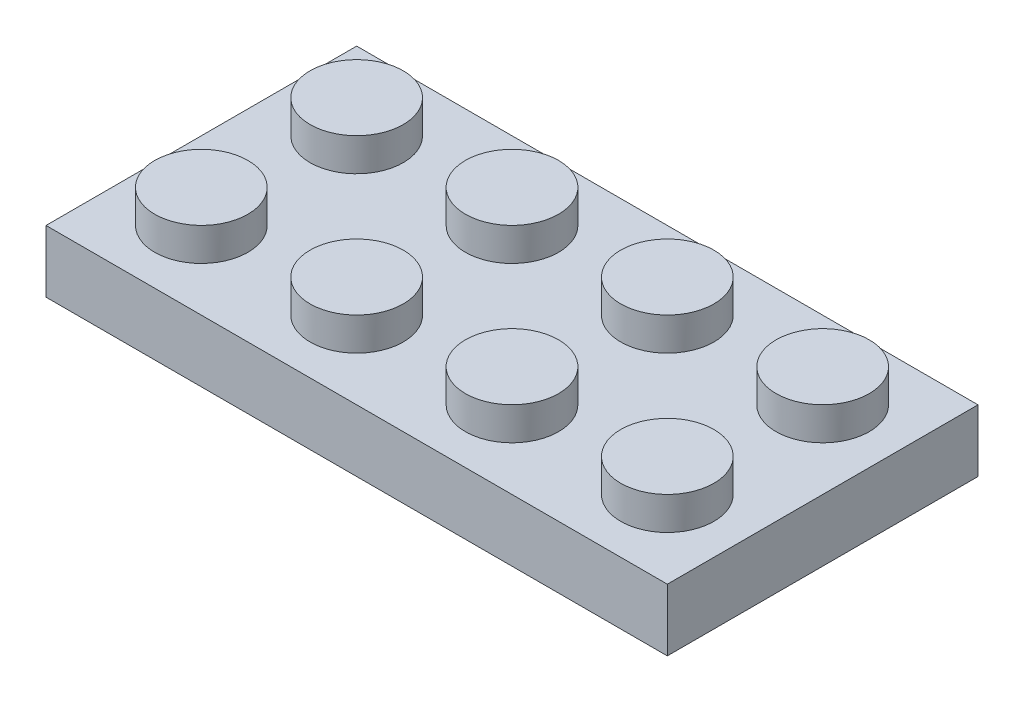
ISO-10303-21;
HEADER;
FILE_DESCRIPTION(('STEP AP214'),'2;1');
FILE_NAME('part.step','',(''),(''),'','','');
FILE_SCHEMA(('AUTOMOTIVE_DESIGN { 1 0 10303 214 1 1 1 1 }'));
ENDSEC;
DATA;
#1=APPLICATION_CONTEXT('core data for automotive mechanical design processes');
#2=APPLICATION_PROTOCOL_DEFINITION('international standard','automotive_design',2000,#1);
#3=PRODUCT_CONTEXT('',#1,'mechanical');
#4=PRODUCT('Part','Part','',(#3));
#5=PRODUCT_RELATED_PRODUCT_CATEGORY('part','',(#4));
#6=PRODUCT_DEFINITION_FORMATION('','',#4);
#7=PRODUCT_DEFINITION_CONTEXT('part definition',#1,'design');
#8=PRODUCT_DEFINITION('design','',#6,#7);
#9=PRODUCT_DEFINITION_SHAPE('','',#8);
#10=(LENGTH_UNIT() NAMED_UNIT(*) SI_UNIT(.MILLI.,.METRE.));
#11=(NAMED_UNIT(*) PLANE_ANGLE_UNIT() SI_UNIT($,.RADIAN.));
#12=(NAMED_UNIT(*) SI_UNIT($,.STERADIAN.) SOLID_ANGLE_UNIT());
#13=UNCERTAINTY_MEASURE_WITH_UNIT(LENGTH_MEASURE(1.E-05),#10,'distance_accuracy_value','');
#14=(GEOMETRIC_REPRESENTATION_CONTEXT(3) GLOBAL_UNCERTAINTY_ASSIGNED_CONTEXT((#13)) GLOBAL_UNIT_ASSIGNED_CONTEXT((#10,
#11,#12)) REPRESENTATION_CONTEXT('',''));
#15=CARTESIAN_POINT('',(0.,0.,0.));
#16=DIRECTION('',(0.,0.,1.));
#17=DIRECTION('',(1.,0.,0.));
#18=AXIS2_PLACEMENT_3D('',#15,#16,#17);
#19=CARTESIAN_POINT('',(0.,0.,0.));
#20=DIRECTION('',(0.,-1.,0.));
#21=DIRECTION('',(0.,0.,-1.));
#22=AXIS2_PLACEMENT_3D('',#19,#20,#21);
#23=PLANE('',#22);
#24=DIRECTION('',(-1.,0.,0.));
#25=VECTOR('',#24,1.);
#26=CARTESIAN_POINT('',(-4.,0.,-4.));
#27=LINE('',#26,#25);
#28=CARTESIAN_POINT('',(28.,0.,-4.));
#29=VERTEX_POINT('',#28);
#30=CARTESIAN_POINT('',(-4.,0.,-4.));
#31=VERTEX_POINT('',#30);
#32=EDGE_CURVE('E230',#29,#31,#27,.T.);
#33=ORIENTED_EDGE('',*,*,#32,.F.);
#34=DIRECTION('',(0.,0.,-1.));
#35=VECTOR('',#34,1.);
#36=CARTESIAN_POINT('',(28.,0.,4.));
#37=LINE('',#36,#35);
#38=CARTESIAN_POINT('',(28.,0.,12.));
#39=VERTEX_POINT('',#38);
#40=EDGE_CURVE('E197',#39,#29,#37,.T.);
#41=ORIENTED_EDGE('',*,*,#40,.F.);
#42=DIRECTION('',(1.,0.,0.));
#43=VECTOR('',#42,1.);
#44=CARTESIAN_POINT('',(-4.,0.,12.));
#45=LINE('',#44,#43);
#46=CARTESIAN_POINT('',(-4.,0.,12.));
#47=VERTEX_POINT('',#46);
#48=EDGE_CURVE('E220',#47,#39,#45,.T.);
#49=ORIENTED_EDGE('',*,*,#48,.F.);
#50=DIRECTION('',(0.,0.,1.));
#51=VECTOR('',#50,1.);
#52=CARTESIAN_POINT('',(-4.,0.,4.));
#53=LINE('',#52,#51);
#54=EDGE_CURVE('E238',#31,#47,#53,.T.);
#55=ORIENTED_EDGE('',*,*,#54,.F.);
#56=EDGE_LOOP('',(#33,#41,#49,#55));
#57=FACE_BOUND('',#56,.T.);
#58=DIRECTION('',(0.,0.,-1.));
#59=VECTOR('',#58,1.);
#60=CARTESIAN_POINT('',(26.4,0.,0.));
#61=LINE('',#60,#59);
#62=CARTESIAN_POINT('',(26.4,0.,10.4));
#63=VERTEX_POINT('',#62);
#64=CARTESIAN_POINT('',(26.4,0.,-2.4));
#65=VERTEX_POINT('',#64);
#66=EDGE_CURVE('E119',#63,#65,#61,.T.);
#67=ORIENTED_EDGE('',*,*,#66,.T.);
#68=DIRECTION('',(-1.,0.,0.));
#69=VECTOR('',#68,1.);
#70=CARTESIAN_POINT('',(0.,0.,-2.4));
#71=LINE('',#70,#69);
#72=CARTESIAN_POINT('',(-2.4,0.,-2.4));
#73=VERTEX_POINT('',#72);
#74=EDGE_CURVE('E123',#65,#73,#71,.T.);
#75=ORIENTED_EDGE('',*,*,#74,.T.);
#76=DIRECTION('',(0.,0.,1.));
#77=VECTOR('',#76,1.);
#78=CARTESIAN_POINT('',(-2.4,0.,0.));
#79=LINE('',#78,#77);
#80=CARTESIAN_POINT('',(-2.4,0.,10.4));
#81=VERTEX_POINT('',#80);
#82=EDGE_CURVE('E111',#73,#81,#79,.T.);
#83=ORIENTED_EDGE('',*,*,#82,.T.);
#84=DIRECTION('',(1.,0.,0.));
#85=VECTOR('',#84,1.);
#86=CARTESIAN_POINT('',(0.,0.,10.4));
#87=LINE('',#86,#85);
#88=EDGE_CURVE('E49',#81,#63,#87,.T.);
#89=ORIENTED_EDGE('',*,*,#88,.T.);
#90=EDGE_LOOP('',(#67,#75,#83,#89));
#91=FACE_BOUND('',#90,.T.);
#92=ADVANCED_FACE('F34',(#57,#91),#23,.T.);
#93=CARTESIAN_POINT('',(-4.,3.2,-4.));
#94=DIRECTION('',(0.,0.,1.));
#95=DIRECTION('',(1.,0.,0.));
#96=AXIS2_PLACEMENT_3D('',#93,#94,#95);
#97=PLANE('',#96);
#98=ORIENTED_EDGE('',*,*,#32,.T.);
#99=DIRECTION('',(0.,-1.,0.));
#100=VECTOR('',#99,1.);
#101=CARTESIAN_POINT('',(-4.,3.2,-4.));
#102=LINE('',#101,#100);
#103=CARTESIAN_POINT('',(-4.,3.2,-4.));
#104=VERTEX_POINT('',#103);
#105=EDGE_CURVE('E235',#104,#31,#102,.T.);
#106=ORIENTED_EDGE('',*,*,#105,.F.);
#107=DIRECTION('',(-1.,0.,0.));
#108=VECTOR('',#107,1.);
#109=CARTESIAN_POINT('',(-4.,3.2,-4.));
#110=LINE('',#109,#108);
#111=CARTESIAN_POINT('',(28.,3.2,-4.));
#112=VERTEX_POINT('',#111);
#113=EDGE_CURVE('E58',#112,#104,#110,.T.);
#114=ORIENTED_EDGE('',*,*,#113,.F.);
#115=DIRECTION('',(0.,-1.,0.));
#116=VECTOR('',#115,1.);
#117=CARTESIAN_POINT('',(28.,3.2,-4.));
#118=LINE('',#117,#116);
#119=EDGE_CURVE('E200',#112,#29,#118,.T.);
#120=ORIENTED_EDGE('',*,*,#119,.T.);
#121=EDGE_LOOP('',(#98,#106,#114,#120));
#122=FACE_BOUND('',#121,.T.);
#123=ADVANCED_FACE('F36',(#122),#97,.F.);
#124=CARTESIAN_POINT('',(-4.,3.2,4.));
#125=DIRECTION('',(1.,0.,0.));
#126=DIRECTION('',(0.,0.,-1.));
#127=AXIS2_PLACEMENT_3D('',#124,#125,#126);
#128=PLANE('',#127);
#129=ORIENTED_EDGE('',*,*,#54,.T.);
#130=DIRECTION('',(0.,-1.,0.));
#131=VECTOR('',#130,1.);
#132=CARTESIAN_POINT('',(-4.,3.2,12.));
#133=LINE('',#132,#131);
#134=CARTESIAN_POINT('',(-4.,3.2,12.));
#135=VERTEX_POINT('',#134);
#136=EDGE_CURVE('E223',#135,#47,#133,.T.);
#137=ORIENTED_EDGE('',*,*,#136,.F.);
#138=DIRECTION('',(0.,0.,1.));
#139=VECTOR('',#138,1.);
#140=CARTESIAN_POINT('',(-4.,3.2,4.));
#141=LINE('',#140,#139);
#142=EDGE_CURVE('E237',#104,#135,#141,.T.);
#143=ORIENTED_EDGE('',*,*,#142,.F.);
#144=ORIENTED_EDGE('',*,*,#105,.T.);
#145=EDGE_LOOP('',(#129,#137,#143,#144));
#146=FACE_BOUND('',#145,.T.);
#147=ADVANCED_FACE('F303',(#146),#128,.F.);
#148=CARTESIAN_POINT('',(0.,3.2,0.));
#149=DIRECTION('',(0.,-1.,0.));
#150=DIRECTION('',(0.,0.,-1.));
#151=AXIS2_PLACEMENT_3D('',#148,#149,#150);
#152=PLANE('',#151);
#153=CARTESIAN_POINT('',(24.,3.2,8.));
#154=DIRECTION('',(0.,-1.,0.));
#155=DIRECTION('',(0.,0.,-1.));
#156=AXIS2_PLACEMENT_3D('',#153,#154,#155);
#157=CIRCLE('',#156,2.4);
#158=CARTESIAN_POINT('',(24.,3.2,5.6));
#159=VERTEX_POINT('',#158);
#160=EDGE_CURVE('E261',#159,#159,#157,.F.);
#161=ORIENTED_EDGE('',*,*,#160,.F.);
#162=EDGE_LOOP('',(#161));
#163=FACE_BOUND('',#162,.T.);
#164=CARTESIAN_POINT('',(24.,3.2,0.));
#165=DIRECTION('',(0.,-1.,0.));
#166=DIRECTION('',(0.,0.,-1.));
#167=AXIS2_PLACEMENT_3D('',#164,#165,#166);
#168=CIRCLE('',#167,2.4);
#169=CARTESIAN_POINT('',(24.,3.2,-2.4));
#170=VERTEX_POINT('',#169);
#171=EDGE_CURVE('E258',#170,#170,#168,.F.);
#172=ORIENTED_EDGE('',*,*,#171,.F.);
#173=EDGE_LOOP('',(#172));
#174=FACE_BOUND('',#173,.T.);
#175=CARTESIAN_POINT('',(16.,3.2,8.));
#176=DIRECTION('',(0.,-1.,0.));
#177=DIRECTION('',(0.,0.,-1.));
#178=AXIS2_PLACEMENT_3D('',#175,#176,#177);
#179=CIRCLE('',#178,2.4);
#180=CARTESIAN_POINT('',(16.,3.2,5.6));
#181=VERTEX_POINT('',#180);
#182=EDGE_CURVE('E255',#181,#181,#179,.F.);
#183=ORIENTED_EDGE('',*,*,#182,.F.);
#184=EDGE_LOOP('',(#183));
#185=FACE_BOUND('',#184,.T.);
#186=CARTESIAN_POINT('',(16.,3.2,0.));
#187=DIRECTION('',(0.,-1.,0.));
#188=DIRECTION('',(0.,0.,-1.));
#189=AXIS2_PLACEMENT_3D('',#186,#187,#188);
#190=CIRCLE('',#189,2.4);
#191=CARTESIAN_POINT('',(16.,3.2,-2.4));
#192=VERTEX_POINT('',#191);
#193=EDGE_CURVE('E252',#192,#192,#190,.F.);
#194=ORIENTED_EDGE('',*,*,#193,.F.);
#195=EDGE_LOOP('',(#194));
#196=FACE_BOUND('',#195,.T.);
#197=CARTESIAN_POINT('',(8.,3.2,8.));
#198=DIRECTION('',(0.,-1.,0.));
#199=DIRECTION('',(0.,0.,-1.));
#200=AXIS2_PLACEMENT_3D('',#197,#198,#199);
#201=CIRCLE('',#200,2.4);
#202=CARTESIAN_POINT('',(8.,3.2,5.6));
#203=VERTEX_POINT('',#202);
#204=EDGE_CURVE('E249',#203,#203,#201,.F.);
#205=ORIENTED_EDGE('',*,*,#204,.F.);
#206=EDGE_LOOP('',(#205));
#207=FACE_BOUND('',#206,.T.);
#208=CARTESIAN_POINT('',(8.,3.2,0.));
#209=DIRECTION('',(0.,-1.,0.));
#210=DIRECTION('',(0.,0.,-1.));
#211=AXIS2_PLACEMENT_3D('',#208,#209,#210);
#212=CIRCLE('',#211,2.4);
#213=CARTESIAN_POINT('',(8.,3.2,-2.4));
#214=VERTEX_POINT('',#213);
#215=EDGE_CURVE('E246',#214,#214,#212,.F.);
#216=ORIENTED_EDGE('',*,*,#215,.F.);
#217=EDGE_LOOP('',(#216));
#218=FACE_BOUND('',#217,.T.);
#219=CARTESIAN_POINT('',(0.,3.2,8.));
#220=DIRECTION('',(0.,-1.,0.));
#221=DIRECTION('',(0.,0.,-1.));
#222=AXIS2_PLACEMENT_3D('',#219,#220,#221);
#223=CIRCLE('',#222,2.4);
#224=CARTESIAN_POINT('',(0.,3.2,5.6));
#225=VERTEX_POINT('',#224);
#226=EDGE_CURVE('E234',#225,#225,#223,.F.);
#227=ORIENTED_EDGE('',*,*,#226,.F.);
#228=EDGE_LOOP('',(#227));
#229=FACE_BOUND('',#228,.T.);
#230=CARTESIAN_POINT('',(0.,3.2,0.));
#231=DIRECTION('',(0.,1.,0.));
#232=DIRECTION('',(0.,0.,1.));
#233=AXIS2_PLACEMENT_3D('',#230,#231,#232);
#234=CIRCLE('',#233,2.4);
#235=CARTESIAN_POINT('',(0.,3.2,2.4));
#236=VERTEX_POINT('',#235);
#237=EDGE_CURVE('E231',#236,#236,#234,.T.);
#238=ORIENTED_EDGE('',*,*,#237,.F.);
#239=EDGE_LOOP('',(#238));
#240=FACE_BOUND('',#239,.T.);
#241=DIRECTION('',(1.,0.,0.));
#242=VECTOR('',#241,1.);
#243=CARTESIAN_POINT('',(-4.,3.2,12.));
#244=LINE('',#243,#242);
#245=CARTESIAN_POINT('',(28.,3.2,12.));
#246=VERTEX_POINT('',#245);
#247=EDGE_CURVE('E221',#135,#246,#244,.T.);
#248=ORIENTED_EDGE('',*,*,#247,.T.);
#249=DIRECTION('',(0.,0.,-1.));
#250=VECTOR('',#249,1.);
#251=CARTESIAN_POINT('',(28.,3.2,4.));
#252=LINE('',#251,#250);
#253=EDGE_CURVE('E198',#246,#112,#252,.T.);
#254=ORIENTED_EDGE('',*,*,#253,.T.);
#255=ORIENTED_EDGE('',*,*,#113,.T.);
#256=ORIENTED_EDGE('',*,*,#142,.T.);
#257=EDGE_LOOP('',(#248,#254,#255,#256));
#258=FACE_BOUND('',#257,.T.);
#259=ADVANCED_FACE('F307',(#163,#174,#185,#196,#207,#218,#229,#240,#258),#152,.F.);
#260=CARTESIAN_POINT('',(0.,4.9,0.));
#261=DIRECTION('',(0.,-1.,0.));
#262=DIRECTION('',(0.,0.,-1.));
#263=AXIS2_PLACEMENT_3D('',#260,#261,#262);
#264=CYLINDRICAL_SURFACE('',#263,2.4);
#265=CARTESIAN_POINT('',(0.,4.9,0.));
#266=DIRECTION('',(0.,1.,0.));
#267=DIRECTION('',(0.,0.,1.));
#268=AXIS2_PLACEMENT_3D('',#265,#266,#267);
#269=CIRCLE('',#268,2.4);
#270=CARTESIAN_POINT('',(0.,4.9,2.4));
#271=VERTEX_POINT('',#270);
#272=EDGE_CURVE('E227',#271,#271,#269,.T.);
#273=ORIENTED_EDGE('',*,*,#272,.F.);
#274=EDGE_LOOP('',(#273));
#275=FACE_BOUND('',#274,.T.);
#276=ORIENTED_EDGE('',*,*,#237,.T.);
#277=EDGE_LOOP('',(#276));
#278=FACE_BOUND('',#277,.T.);
#279=ADVANCED_FACE('F314',(#275,#278),#264,.T.);
#280=CARTESIAN_POINT('',(0.,4.9,0.));
#281=DIRECTION('',(0.,1.,0.));
#282=DIRECTION('',(0.,0.,1.));
#283=AXIS2_PLACEMENT_3D('',#280,#281,#282);
#284=PLANE('',#283);
#285=ORIENTED_EDGE('',*,*,#272,.T.);
#286=EDGE_LOOP('',(#285));
#287=FACE_BOUND('',#286,.T.);
#288=ADVANCED_FACE('F382',(#287),#284,.T.);
#289=CARTESIAN_POINT('',(-4.,3.2,12.));
#290=DIRECTION('',(0.,0.,-1.));
#291=DIRECTION('',(-1.,0.,0.));
#292=AXIS2_PLACEMENT_3D('',#289,#290,#291);
#293=PLANE('',#292);
#294=ORIENTED_EDGE('',*,*,#48,.T.);
#295=DIRECTION('',(0.,-1.,0.));
#296=VECTOR('',#295,1.);
#297=CARTESIAN_POINT('',(28.,3.2,12.));
#298=LINE('',#297,#296);
#299=EDGE_CURVE('E194',#246,#39,#298,.T.);
#300=ORIENTED_EDGE('',*,*,#299,.F.);
#301=ORIENTED_EDGE('',*,*,#247,.F.);
#302=ORIENTED_EDGE('',*,*,#136,.T.);
#303=EDGE_LOOP('',(#294,#300,#301,#302));
#304=FACE_BOUND('',#303,.T.);
#305=ADVANCED_FACE('F322',(#304),#293,.F.);
#306=CARTESIAN_POINT('',(0.,4.9,8.));
#307=DIRECTION('',(0.,-1.,0.));
#308=DIRECTION('',(0.,0.,-1.));
#309=AXIS2_PLACEMENT_3D('',#306,#307,#308);
#310=CYLINDRICAL_SURFACE('',#309,2.4);
#311=CARTESIAN_POINT('',(0.,4.9,8.));
#312=DIRECTION('',(0.,1.,0.));
#313=DIRECTION('',(0.,0.,1.));
#314=AXIS2_PLACEMENT_3D('',#311,#312,#313);
#315=CIRCLE('',#314,2.4);
#316=CARTESIAN_POINT('',(0.,4.9,10.4));
#317=VERTEX_POINT('',#316);
#318=EDGE_CURVE('E217',#317,#317,#315,.T.);
#319=ORIENTED_EDGE('',*,*,#318,.F.);
#320=EDGE_LOOP('',(#319));
#321=FACE_BOUND('',#320,.T.);
#322=ORIENTED_EDGE('',*,*,#226,.T.);
#323=EDGE_LOOP('',(#322));
#324=FACE_BOUND('',#323,.T.);
#325=ADVANCED_FACE('F375',(#321,#324),#310,.T.);
#326=CARTESIAN_POINT('',(0.,4.9,8.));
#327=DIRECTION('',(0.,1.,0.));
#328=DIRECTION('',(0.,0.,1.));
#329=AXIS2_PLACEMENT_3D('',#326,#327,#328);
#330=PLANE('',#329);
#331=ORIENTED_EDGE('',*,*,#318,.T.);
#332=EDGE_LOOP('',(#331));
#333=FACE_BOUND('',#332,.T.);
#334=ADVANCED_FACE('F371',(#333),#330,.T.);
#335=CARTESIAN_POINT('',(8.,4.9,0.));
#336=DIRECTION('',(0.,-1.,0.));
#337=DIRECTION('',(0.,0.,-1.));
#338=AXIS2_PLACEMENT_3D('',#335,#336,#337);
#339=CYLINDRICAL_SURFACE('',#338,2.4);
#340=CARTESIAN_POINT('',(8.,4.9,0.));
#341=DIRECTION('',(0.,1.,0.));
#342=DIRECTION('',(0.,0.,1.));
#343=AXIS2_PLACEMENT_3D('',#340,#341,#342);
#344=CIRCLE('',#343,2.4);
#345=CARTESIAN_POINT('',(8.,4.9,2.4));
#346=VERTEX_POINT('',#345);
#347=EDGE_CURVE('E214',#346,#346,#344,.T.);
#348=ORIENTED_EDGE('',*,*,#347,.F.);
#349=EDGE_LOOP('',(#348));
#350=FACE_BOUND('',#349,.T.);
#351=ORIENTED_EDGE('',*,*,#215,.T.);
#352=EDGE_LOOP('',(#351));
#353=FACE_BOUND('',#352,.T.);
#354=ADVANCED_FACE('F367',(#350,#353),#339,.T.);
#355=CARTESIAN_POINT('',(8.,4.9,0.));
#356=DIRECTION('',(0.,1.,0.));
#357=DIRECTION('',(0.,0.,1.));
#358=AXIS2_PLACEMENT_3D('',#355,#356,#357);
#359=PLANE('',#358);
#360=ORIENTED_EDGE('',*,*,#347,.T.);
#361=EDGE_LOOP('',(#360));
#362=FACE_BOUND('',#361,.T.);
#363=ADVANCED_FACE('F363',(#362),#359,.T.);
#364=CARTESIAN_POINT('',(8.,4.9,8.));
#365=DIRECTION('',(0.,-1.,0.));
#366=DIRECTION('',(0.,0.,-1.));
#367=AXIS2_PLACEMENT_3D('',#364,#365,#366);
#368=CYLINDRICAL_SURFACE('',#367,2.4);
#369=CARTESIAN_POINT('',(8.,4.9,8.));
#370=DIRECTION('',(0.,1.,0.));
#371=DIRECTION('',(0.,0.,1.));
#372=AXIS2_PLACEMENT_3D('',#369,#370,#371);
#373=CIRCLE('',#372,2.4);
#374=CARTESIAN_POINT('',(8.,4.9,10.4));
#375=VERTEX_POINT('',#374);
#376=EDGE_CURVE('E211',#375,#375,#373,.T.);
#377=ORIENTED_EDGE('',*,*,#376,.F.);
#378=EDGE_LOOP('',(#377));
#379=FACE_BOUND('',#378,.T.);
#380=ORIENTED_EDGE('',*,*,#204,.T.);
#381=EDGE_LOOP('',(#380));
#382=FACE_BOUND('',#381,.T.);
#383=ADVANCED_FACE('F359',(#379,#382),#368,.T.);
#384=CARTESIAN_POINT('',(8.,4.9,8.));
#385=DIRECTION('',(0.,1.,0.));
#386=DIRECTION('',(0.,0.,1.));
#387=AXIS2_PLACEMENT_3D('',#384,#385,#386);
#388=PLANE('',#387);
#389=ORIENTED_EDGE('',*,*,#376,.T.);
#390=EDGE_LOOP('',(#389));
#391=FACE_BOUND('',#390,.T.);
#392=ADVANCED_FACE('F355',(#391),#388,.T.);
#393=CARTESIAN_POINT('',(16.,4.9,0.));
#394=DIRECTION('',(0.,-1.,0.));
#395=DIRECTION('',(0.,0.,-1.));
#396=AXIS2_PLACEMENT_3D('',#393,#394,#395);
#397=CYLINDRICAL_SURFACE('',#396,2.4);
#398=CARTESIAN_POINT('',(16.,4.9,0.));
#399=DIRECTION('',(0.,1.,0.));
#400=DIRECTION('',(0.,0.,1.));
#401=AXIS2_PLACEMENT_3D('',#398,#399,#400);
#402=CIRCLE('',#401,2.4);
#403=CARTESIAN_POINT('',(16.,4.9,2.4));
#404=VERTEX_POINT('',#403);
#405=EDGE_CURVE('E208',#404,#404,#402,.T.);
#406=ORIENTED_EDGE('',*,*,#405,.F.);
#407=EDGE_LOOP('',(#406));
#408=FACE_BOUND('',#407,.T.);
#409=ORIENTED_EDGE('',*,*,#193,.T.);
#410=EDGE_LOOP('',(#409));
#411=FACE_BOUND('',#410,.T.);
#412=ADVANCED_FACE('F351',(#408,#411),#397,.T.);
#413=CARTESIAN_POINT('',(16.,4.9,0.));
#414=DIRECTION('',(0.,1.,0.));
#415=DIRECTION('',(0.,0.,1.));
#416=AXIS2_PLACEMENT_3D('',#413,#414,#415);
#417=PLANE('',#416);
#418=ORIENTED_EDGE('',*,*,#405,.T.);
#419=EDGE_LOOP('',(#418));
#420=FACE_BOUND('',#419,.T.);
#421=ADVANCED_FACE('F347',(#420),#417,.T.);
#422=CARTESIAN_POINT('',(16.,4.9,8.));
#423=DIRECTION('',(0.,-1.,0.));
#424=DIRECTION('',(0.,0.,-1.));
#425=AXIS2_PLACEMENT_3D('',#422,#423,#424);
#426=CYLINDRICAL_SURFACE('',#425,2.4);
#427=CARTESIAN_POINT('',(16.,4.9,8.));
#428=DIRECTION('',(0.,1.,0.));
#429=DIRECTION('',(0.,0.,1.));
#430=AXIS2_PLACEMENT_3D('',#427,#428,#429);
#431=CIRCLE('',#430,2.4);
#432=CARTESIAN_POINT('',(16.,4.9,10.4));
#433=VERTEX_POINT('',#432);
#434=EDGE_CURVE('E205',#433,#433,#431,.T.);
#435=ORIENTED_EDGE('',*,*,#434,.F.);
#436=EDGE_LOOP('',(#435));
#437=FACE_BOUND('',#436,.T.);
#438=ORIENTED_EDGE('',*,*,#182,.T.);
#439=EDGE_LOOP('',(#438));
#440=FACE_BOUND('',#439,.T.);
#441=ADVANCED_FACE('F340',(#437,#440),#426,.T.);
#442=CARTESIAN_POINT('',(16.,4.9,8.));
#443=DIRECTION('',(0.,1.,0.));
#444=DIRECTION('',(0.,0.,1.));
#445=AXIS2_PLACEMENT_3D('',#442,#443,#444);
#446=PLANE('',#445);
#447=ORIENTED_EDGE('',*,*,#434,.T.);
#448=EDGE_LOOP('',(#447));
#449=FACE_BOUND('',#448,.T.);
#450=ADVANCED_FACE('F331',(#449),#446,.T.);
#451=CARTESIAN_POINT('',(28.,3.2,4.));
#452=DIRECTION('',(-1.,0.,0.));
#453=DIRECTION('',(0.,0.,1.));
#454=AXIS2_PLACEMENT_3D('',#451,#452,#453);
#455=PLANE('',#454);
#456=ORIENTED_EDGE('',*,*,#40,.T.);
#457=ORIENTED_EDGE('',*,*,#119,.F.);
#458=ORIENTED_EDGE('',*,*,#253,.F.);
#459=ORIENTED_EDGE('',*,*,#299,.T.);
#460=EDGE_LOOP('',(#456,#457,#458,#459));
#461=FACE_BOUND('',#460,.T.);
#462=ADVANCED_FACE('F328',(#461),#455,.F.);
#463=CARTESIAN_POINT('',(24.,4.9,0.));
#464=DIRECTION('',(0.,-1.,0.));
#465=DIRECTION('',(0.,0.,-1.));
#466=AXIS2_PLACEMENT_3D('',#463,#464,#465);
#467=CYLINDRICAL_SURFACE('',#466,2.4);
#468=CARTESIAN_POINT('',(24.,4.9,0.));
#469=DIRECTION('',(0.,1.,0.));
#470=DIRECTION('',(0.,0.,1.));
#471=AXIS2_PLACEMENT_3D('',#468,#469,#470);
#472=CIRCLE('',#471,2.4);
#473=CARTESIAN_POINT('',(24.,4.9,2.4));
#474=VERTEX_POINT('',#473);
#475=EDGE_CURVE('E191',#474,#474,#472,.T.);
#476=ORIENTED_EDGE('',*,*,#475,.F.);
#477=EDGE_LOOP('',(#476));
#478=FACE_BOUND('',#477,.T.);
#479=ORIENTED_EDGE('',*,*,#171,.T.);
#480=EDGE_LOOP('',(#479));
#481=FACE_BOUND('',#480,.T.);
#482=ADVANCED_FACE('F330',(#478,#481),#467,.T.);
#483=CARTESIAN_POINT('',(24.,4.9,0.));
#484=DIRECTION('',(0.,1.,0.));
#485=DIRECTION('',(0.,0.,1.));
#486=AXIS2_PLACEMENT_3D('',#483,#484,#485);
#487=PLANE('',#486);
#488=ORIENTED_EDGE('',*,*,#475,.T.);
#489=EDGE_LOOP('',(#488));
#490=FACE_BOUND('',#489,.T.);
#491=ADVANCED_FACE('F337',(#490),#487,.T.);
#492=CARTESIAN_POINT('',(24.,4.9,8.));
#493=DIRECTION('',(0.,-1.,0.));
#494=DIRECTION('',(0.,0.,-1.));
#495=AXIS2_PLACEMENT_3D('',#492,#493,#494);
#496=CYLINDRICAL_SURFACE('',#495,2.4);
#497=CARTESIAN_POINT('',(24.,4.9,8.));
#498=DIRECTION('',(0.,1.,0.));
#499=DIRECTION('',(0.,0.,1.));
#500=AXIS2_PLACEMENT_3D('',#497,#498,#499);
#501=CIRCLE('',#500,2.4);
#502=CARTESIAN_POINT('',(24.,4.9,10.4));
#503=VERTEX_POINT('',#502);
#504=EDGE_CURVE('E140',#503,#503,#501,.T.);
#505=ORIENTED_EDGE('',*,*,#504,.F.);
#506=EDGE_LOOP('',(#505));
#507=FACE_BOUND('',#506,.T.);
#508=ORIENTED_EDGE('',*,*,#160,.T.);
#509=EDGE_LOOP('',(#508));
#510=FACE_BOUND('',#509,.T.);
#511=ADVANCED_FACE('F464',(#507,#510),#496,.T.);
#512=CARTESIAN_POINT('',(24.,4.9,8.));
#513=DIRECTION('',(0.,1.,0.));
#514=DIRECTION('',(0.,0.,1.));
#515=AXIS2_PLACEMENT_3D('',#512,#513,#514);
#516=PLANE('',#515);
#517=ORIENTED_EDGE('',*,*,#504,.T.);
#518=EDGE_LOOP('',(#517));
#519=FACE_BOUND('',#518,.T.);
#520=ADVANCED_FACE('F473',(#519),#516,.T.);
#521=CARTESIAN_POINT('',(-4.,3.2,-2.4));
#522=DIRECTION('',(0.,0.,1.));
#523=DIRECTION('',(1.,0.,0.));
#524=AXIS2_PLACEMENT_3D('',#521,#522,#523);
#525=PLANE('',#524);
#526=ORIENTED_EDGE('',*,*,#74,.F.);
#527=DIRECTION('',(0.,-1.,0.));
#528=VECTOR('',#527,1.);
#529=CARTESIAN_POINT('',(26.4,3.2,-2.4));
#530=LINE('',#529,#528);
#531=CARTESIAN_POINT('',(26.4,1.6,-2.4));
#532=VERTEX_POINT('',#531);
#533=EDGE_CURVE('E116',#532,#65,#530,.T.);
#534=ORIENTED_EDGE('',*,*,#533,.F.);
#535=DIRECTION('',(-1.,0.,0.));
#536=VECTOR('',#535,1.);
#537=CARTESIAN_POINT('',(0.,1.6,-2.4));
#538=LINE('',#537,#536);
#539=CARTESIAN_POINT('',(-2.4,1.6,-2.4));
#540=VERTEX_POINT('',#539);
#541=EDGE_CURVE('E101',#532,#540,#538,.T.);
#542=ORIENTED_EDGE('',*,*,#541,.T.);
#543=DIRECTION('',(0.,-1.,0.));
#544=VECTOR('',#543,1.);
#545=CARTESIAN_POINT('',(-2.4,3.2,-2.4));
#546=LINE('',#545,#544);
#547=EDGE_CURVE('E136',#540,#73,#546,.T.);
#548=ORIENTED_EDGE('',*,*,#547,.T.);
#549=EDGE_LOOP('',(#526,#534,#542,#548));
#550=FACE_BOUND('',#549,.T.);
#551=ADVANCED_FACE('F121',(#550),#525,.T.);
#552=CARTESIAN_POINT('',(-2.4,3.2,4.));
#553=DIRECTION('',(1.,0.,0.));
#554=DIRECTION('',(0.,0.,-1.));
#555=AXIS2_PLACEMENT_3D('',#552,#553,#554);
#556=PLANE('',#555);
#557=ORIENTED_EDGE('',*,*,#82,.F.);
#558=ORIENTED_EDGE('',*,*,#547,.F.);
#559=DIRECTION('',(0.,0.,1.));
#560=VECTOR('',#559,1.);
#561=CARTESIAN_POINT('',(-2.4,1.6,0.));
#562=LINE('',#561,#560);
#563=CARTESIAN_POINT('',(-2.4,1.6,10.4));
#564=VERTEX_POINT('',#563);
#565=EDGE_CURVE('E107',#540,#564,#562,.T.);
#566=ORIENTED_EDGE('',*,*,#565,.T.);
#567=DIRECTION('',(0.,-1.,0.));
#568=VECTOR('',#567,1.);
#569=CARTESIAN_POINT('',(-2.4,3.2,10.4));
#570=LINE('',#569,#568);
#571=EDGE_CURVE('E131',#564,#81,#570,.T.);
#572=ORIENTED_EDGE('',*,*,#571,.T.);
#573=EDGE_LOOP('',(#557,#558,#566,#572));
#574=FACE_BOUND('',#573,.T.);
#575=ADVANCED_FACE('F499',(#574),#556,.T.);
#576=CARTESIAN_POINT('',(0.,1.6,0.));
#577=DIRECTION('',(0.,-1.,0.));
#578=DIRECTION('',(0.,0.,-1.));
#579=AXIS2_PLACEMENT_3D('',#576,#577,#578);
#580=PLANE('',#579);
#581=CARTESIAN_POINT('',(20.,1.6,4.));
#582=DIRECTION('',(0.,-1.,0.));
#583=DIRECTION('',(0.,0.,-1.));
#584=AXIS2_PLACEMENT_3D('',#581,#582,#583);
#585=CIRCLE('',#584,3.255);
#586=CARTESIAN_POINT('',(20.,1.6,0.745));
#587=VERTEX_POINT('',#586);
#588=EDGE_CURVE('E821',#587,#587,#585,.T.);
#589=ORIENTED_EDGE('',*,*,#588,.F.);
#590=EDGE_LOOP('',(#589));
#591=FACE_BOUND('',#590,.T.);
#592=CARTESIAN_POINT('',(12.,1.6,4.));
#593=DIRECTION('',(0.,-1.,0.));
#594=DIRECTION('',(0.,0.,-1.));
#595=AXIS2_PLACEMENT_3D('',#592,#593,#594);
#596=CIRCLE('',#595,3.255);
#597=CARTESIAN_POINT('',(12.,1.6,0.745));
#598=VERTEX_POINT('',#597);
#599=EDGE_CURVE('E824',#598,#598,#596,.T.);
#600=ORIENTED_EDGE('',*,*,#599,.F.);
#601=EDGE_LOOP('',(#600));
#602=FACE_BOUND('',#601,.T.);
#603=CARTESIAN_POINT('',(4.,1.6,4.));
#604=DIRECTION('',(0.,-1.,0.));
#605=DIRECTION('',(0.,0.,-1.));
#606=AXIS2_PLACEMENT_3D('',#603,#604,#605);
#607=CIRCLE('',#606,3.255);
#608=CARTESIAN_POINT('',(4.,1.6,0.745));
#609=VERTEX_POINT('',#608);
#610=EDGE_CURVE('E838',#609,#609,#607,.T.);
#611=ORIENTED_EDGE('',*,*,#610,.F.);
#612=EDGE_LOOP('',(#611));
#613=FACE_BOUND('',#612,.T.);
#614=CARTESIAN_POINT('',(24.,1.6,8.));
#615=DIRECTION('',(0.,-1.,0.));
#616=DIRECTION('',(0.,0.,-1.));
#617=AXIS2_PLACEMENT_3D('',#614,#615,#616);
#618=CIRCLE('',#617,0.8);
#619=CARTESIAN_POINT('',(24.,1.6,7.2));
#620=VERTEX_POINT('',#619);
#621=EDGE_CURVE('E137',#620,#620,#618,.F.);
#622=ORIENTED_EDGE('',*,*,#621,.T.);
#623=EDGE_LOOP('',(#622));
#624=FACE_BOUND('',#623,.T.);
#625=CARTESIAN_POINT('',(24.,1.6,0.));
#626=DIRECTION('',(0.,-1.,0.));
#627=DIRECTION('',(0.,0.,-1.));
#628=AXIS2_PLACEMENT_3D('',#625,#626,#627);
#629=CIRCLE('',#628,0.8);
#630=CARTESIAN_POINT('',(24.,1.6,-0.8));
#631=VERTEX_POINT('',#630);
#632=EDGE_CURVE('E141',#631,#631,#629,.F.);
#633=ORIENTED_EDGE('',*,*,#632,.T.);
#634=EDGE_LOOP('',(#633));
#635=FACE_BOUND('',#634,.T.);
#636=CARTESIAN_POINT('',(16.,1.6,8.));
#637=DIRECTION('',(0.,-1.,0.));
#638=DIRECTION('',(0.,0.,-1.));
#639=AXIS2_PLACEMENT_3D('',#636,#637,#638);
#640=CIRCLE('',#639,0.8);
#641=CARTESIAN_POINT('',(16.,1.6,7.2));
#642=VERTEX_POINT('',#641);
#643=EDGE_CURVE('E144',#642,#642,#640,.F.);
#644=ORIENTED_EDGE('',*,*,#643,.T.);
#645=EDGE_LOOP('',(#644));
#646=FACE_BOUND('',#645,.T.);
#647=CARTESIAN_POINT('',(16.,1.6,0.));
#648=DIRECTION('',(0.,-1.,0.));
#649=DIRECTION('',(0.,0.,-1.));
#650=AXIS2_PLACEMENT_3D('',#647,#648,#649);
#651=CIRCLE('',#650,0.8);
#652=CARTESIAN_POINT('',(16.,1.6,-0.8));
#653=VERTEX_POINT('',#652);
#654=EDGE_CURVE('E147',#653,#653,#651,.F.);
#655=ORIENTED_EDGE('',*,*,#654,.T.);
#656=EDGE_LOOP('',(#655));
#657=FACE_BOUND('',#656,.T.);
#658=CARTESIAN_POINT('',(8.,1.6,8.));
#659=DIRECTION('',(0.,-1.,0.));
#660=DIRECTION('',(0.,0.,-1.));
#661=AXIS2_PLACEMENT_3D('',#658,#659,#660);
#662=CIRCLE('',#661,0.8);
#663=CARTESIAN_POINT('',(8.,1.6,7.2));
#664=VERTEX_POINT('',#663);
#665=EDGE_CURVE('E150',#664,#664,#662,.F.);
#666=ORIENTED_EDGE('',*,*,#665,.T.);
#667=EDGE_LOOP('',(#666));
#668=FACE_BOUND('',#667,.T.);
#669=CARTESIAN_POINT('',(8.,1.6,0.));
#670=DIRECTION('',(0.,-1.,0.));
#671=DIRECTION('',(0.,0.,-1.));
#672=AXIS2_PLACEMENT_3D('',#669,#670,#671);
#673=CIRCLE('',#672,0.8);
#674=CARTESIAN_POINT('',(8.,1.6,-0.8));
#675=VERTEX_POINT('',#674);
#676=EDGE_CURVE('E153',#675,#675,#673,.F.);
#677=ORIENTED_EDGE('',*,*,#676,.T.);
#678=EDGE_LOOP('',(#677));
#679=FACE_BOUND('',#678,.T.);
#680=CARTESIAN_POINT('',(0.,1.6,8.));
#681=DIRECTION('',(0.,-1.,0.));
#682=DIRECTION('',(0.,0.,-1.));
#683=AXIS2_PLACEMENT_3D('',#680,#681,#682);
#684=CIRCLE('',#683,0.8);
#685=CARTESIAN_POINT('',(0.,1.6,7.2));
#686=VERTEX_POINT('',#685);
#687=EDGE_CURVE('E156',#686,#686,#684,.F.);
#688=ORIENTED_EDGE('',*,*,#687,.T.);
#689=EDGE_LOOP('',(#688));
#690=FACE_BOUND('',#689,.T.);
#691=CARTESIAN_POINT('',(0.,1.6,0.));
#692=DIRECTION('',(0.,-1.,0.));
#693=DIRECTION('',(0.,0.,-1.));
#694=AXIS2_PLACEMENT_3D('',#691,#692,#693);
#695=CIRCLE('',#694,0.8);
#696=CARTESIAN_POINT('',(0.,1.6,-0.8));
#697=VERTEX_POINT('',#696);
#698=EDGE_CURVE('E159',#697,#697,#695,.F.);
#699=ORIENTED_EDGE('',*,*,#698,.T.);
#700=EDGE_LOOP('',(#699));
#701=FACE_BOUND('',#700,.T.);
#702=DIRECTION('',(1.,0.,0.));
#703=VECTOR('',#702,1.);
#704=CARTESIAN_POINT('',(0.,1.6,10.4));
#705=LINE('',#704,#703);
#706=CARTESIAN_POINT('',(26.4,1.6,10.4));
#707=VERTEX_POINT('',#706);
#708=EDGE_CURVE('E134',#564,#707,#705,.T.);
#709=ORIENTED_EDGE('',*,*,#708,.F.);
#710=ORIENTED_EDGE('',*,*,#565,.F.);
#711=ORIENTED_EDGE('',*,*,#541,.F.);
#712=DIRECTION('',(0.,0.,-1.));
#713=VECTOR('',#712,1.);
#714=CARTESIAN_POINT('',(26.4,1.6,0.));
#715=LINE('',#714,#713);
#716=EDGE_CURVE('E105',#707,#532,#715,.T.);
#717=ORIENTED_EDGE('',*,*,#716,.F.);
#718=EDGE_LOOP('',(#709,#710,#711,#717));
#719=FACE_BOUND('',#718,.T.);
#720=ADVANCED_FACE('F104',(#591,#602,#613,#624,#635,#646,#657,#668,#679,#690,#701,#719),#580,.T.);
#721=CARTESIAN_POINT('',(0.,4.9,0.));
#722=DIRECTION('',(0.,-1.,0.));
#723=DIRECTION('',(0.,0.,-1.));
#724=AXIS2_PLACEMENT_3D('',#721,#722,#723);
#725=CYLINDRICAL_SURFACE('',#724,0.8);
#726=CARTESIAN_POINT('',(0.,3.3,0.));
#727=DIRECTION('',(0.,1.,0.));
#728=DIRECTION('',(0.,0.,1.));
#729=AXIS2_PLACEMENT_3D('',#726,#727,#728);
#730=CIRCLE('',#729,0.8);
#731=CARTESIAN_POINT('',(0.,3.3,0.8));
#732=VERTEX_POINT('',#731);
#733=EDGE_CURVE('E133',#732,#732,#730,.T.);
#734=ORIENTED_EDGE('',*,*,#733,.T.);
#735=EDGE_LOOP('',(#734));
#736=FACE_BOUND('',#735,.T.);
#737=ORIENTED_EDGE('',*,*,#698,.F.);
#738=EDGE_LOOP('',(#737));
#739=FACE_BOUND('',#738,.T.);
#740=ADVANCED_FACE('F515',(#736,#739),#725,.F.);
#741=CARTESIAN_POINT('',(0.,3.3,0.));
#742=DIRECTION('',(0.,1.,0.));
#743=DIRECTION('',(0.,0.,1.));
#744=AXIS2_PLACEMENT_3D('',#741,#742,#743);
#745=PLANE('',#744);
#746=ORIENTED_EDGE('',*,*,#733,.F.);
#747=EDGE_LOOP('',(#746));
#748=FACE_BOUND('',#747,.T.);
#749=ADVANCED_FACE('F520',(#748),#745,.F.);
#750=CARTESIAN_POINT('',(-4.,3.2,10.4));
#751=DIRECTION('',(0.,0.,-1.));
#752=DIRECTION('',(-1.,0.,0.));
#753=AXIS2_PLACEMENT_3D('',#750,#751,#752);
#754=PLANE('',#753);
#755=ORIENTED_EDGE('',*,*,#88,.F.);
#756=ORIENTED_EDGE('',*,*,#571,.F.);
#757=ORIENTED_EDGE('',*,*,#708,.T.);
#758=DIRECTION('',(0.,-1.,0.));
#759=VECTOR('',#758,1.);
#760=CARTESIAN_POINT('',(26.4,3.2,10.4));
#761=LINE('',#760,#759);
#762=EDGE_CURVE('E118',#707,#63,#761,.T.);
#763=ORIENTED_EDGE('',*,*,#762,.T.);
#764=EDGE_LOOP('',(#755,#756,#757,#763));
#765=FACE_BOUND('',#764,.T.);
#766=ADVANCED_FACE('F530',(#765),#754,.T.);
#767=CARTESIAN_POINT('',(0.,4.9,8.));
#768=DIRECTION('',(0.,-1.,0.));
#769=DIRECTION('',(0.,0.,-1.));
#770=AXIS2_PLACEMENT_3D('',#767,#768,#769);
#771=CYLINDRICAL_SURFACE('',#770,0.8);
#772=CARTESIAN_POINT('',(0.,3.3,8.));
#773=DIRECTION('',(0.,1.,0.));
#774=DIRECTION('',(0.,0.,1.));
#775=AXIS2_PLACEMENT_3D('',#772,#773,#774);
#776=CIRCLE('',#775,0.8);
#777=CARTESIAN_POINT('',(0.,3.3,8.8));
#778=VERTEX_POINT('',#777);
#779=EDGE_CURVE('E167',#778,#778,#776,.T.);
#780=ORIENTED_EDGE('',*,*,#779,.T.);
#781=EDGE_LOOP('',(#780));
#782=FACE_BOUND('',#781,.T.);
#783=ORIENTED_EDGE('',*,*,#687,.F.);
#784=EDGE_LOOP('',(#783));
#785=FACE_BOUND('',#784,.T.);
#786=ADVANCED_FACE('F541',(#782,#785),#771,.F.);
#787=CARTESIAN_POINT('',(0.,3.3,8.));
#788=DIRECTION('',(0.,1.,0.));
#789=DIRECTION('',(0.,0.,1.));
#790=AXIS2_PLACEMENT_3D('',#787,#788,#789);
#791=PLANE('',#790);
#792=ORIENTED_EDGE('',*,*,#779,.F.);
#793=EDGE_LOOP('',(#792));
#794=FACE_BOUND('',#793,.T.);
#795=ADVANCED_FACE('F550',(#794),#791,.F.);
#796=CARTESIAN_POINT('',(8.,4.9,0.));
#797=DIRECTION('',(0.,-1.,0.));
#798=DIRECTION('',(0.,0.,-1.));
#799=AXIS2_PLACEMENT_3D('',#796,#797,#798);
#800=CYLINDRICAL_SURFACE('',#799,0.8);
#801=CARTESIAN_POINT('',(8.,3.3,0.));
#802=DIRECTION('',(0.,1.,0.));
#803=DIRECTION('',(0.,0.,1.));
#804=AXIS2_PLACEMENT_3D('',#801,#802,#803);
#805=CIRCLE('',#804,0.8);
#806=CARTESIAN_POINT('',(8.,3.3,0.8));
#807=VERTEX_POINT('',#806);
#808=EDGE_CURVE('E170',#807,#807,#805,.T.);
#809=ORIENTED_EDGE('',*,*,#808,.T.);
#810=EDGE_LOOP('',(#809));
#811=FACE_BOUND('',#810,.T.);
#812=ORIENTED_EDGE('',*,*,#676,.F.);
#813=EDGE_LOOP('',(#812));
#814=FACE_BOUND('',#813,.T.);
#815=ADVANCED_FACE('F560',(#811,#814),#800,.F.);
#816=CARTESIAN_POINT('',(8.,3.3,0.));
#817=DIRECTION('',(0.,1.,0.));
#818=DIRECTION('',(0.,0.,1.));
#819=AXIS2_PLACEMENT_3D('',#816,#817,#818);
#820=PLANE('',#819);
#821=ORIENTED_EDGE('',*,*,#808,.F.);
#822=EDGE_LOOP('',(#821));
#823=FACE_BOUND('',#822,.T.);
#824=ADVANCED_FACE('F570',(#823),#820,.F.);
#825=CARTESIAN_POINT('',(8.,4.9,8.));
#826=DIRECTION('',(0.,-1.,0.));
#827=DIRECTION('',(0.,0.,-1.));
#828=AXIS2_PLACEMENT_3D('',#825,#826,#827);
#829=CYLINDRICAL_SURFACE('',#828,0.8);
#830=CARTESIAN_POINT('',(8.,3.3,8.));
#831=DIRECTION('',(0.,1.,0.));
#832=DIRECTION('',(0.,0.,1.));
#833=AXIS2_PLACEMENT_3D('',#830,#831,#832);
#834=CIRCLE('',#833,0.8);
#835=CARTESIAN_POINT('',(8.,3.3,8.8));
#836=VERTEX_POINT('',#835);
#837=EDGE_CURVE('E173',#836,#836,#834,.T.);
#838=ORIENTED_EDGE('',*,*,#837,.T.);
#839=EDGE_LOOP('',(#838));
#840=FACE_BOUND('',#839,.T.);
#841=ORIENTED_EDGE('',*,*,#665,.F.);
#842=EDGE_LOOP('',(#841));
#843=FACE_BOUND('',#842,.T.);
#844=ADVANCED_FACE('F580',(#840,#843),#829,.F.);
#845=CARTESIAN_POINT('',(8.,3.3,8.));
#846=DIRECTION('',(0.,1.,0.));
#847=DIRECTION('',(0.,0.,1.));
#848=AXIS2_PLACEMENT_3D('',#845,#846,#847);
#849=PLANE('',#848);
#850=ORIENTED_EDGE('',*,*,#837,.F.);
#851=EDGE_LOOP('',(#850));
#852=FACE_BOUND('',#851,.T.);
#853=ADVANCED_FACE('F590',(#852),#849,.F.);
#854=CARTESIAN_POINT('',(16.,4.9,0.));
#855=DIRECTION('',(0.,-1.,0.));
#856=DIRECTION('',(0.,0.,-1.));
#857=AXIS2_PLACEMENT_3D('',#854,#855,#856);
#858=CYLINDRICAL_SURFACE('',#857,0.8);
#859=CARTESIAN_POINT('',(16.,3.3,0.));
#860=DIRECTION('',(0.,1.,0.));
#861=DIRECTION('',(0.,0.,1.));
#862=AXIS2_PLACEMENT_3D('',#859,#860,#861);
#863=CIRCLE('',#862,0.8);
#864=CARTESIAN_POINT('',(16.,3.3,0.8));
#865=VERTEX_POINT('',#864);
#866=EDGE_CURVE('E127',#865,#865,#863,.T.);
#867=ORIENTED_EDGE('',*,*,#866,.T.);
#868=EDGE_LOOP('',(#867));
#869=FACE_BOUND('',#868,.T.);
#870=ORIENTED_EDGE('',*,*,#654,.F.);
#871=EDGE_LOOP('',(#870));
#872=FACE_BOUND('',#871,.T.);
#873=ADVANCED_FACE('F600',(#869,#872),#858,.F.);
#874=CARTESIAN_POINT('',(16.,3.3,0.));
#875=DIRECTION('',(0.,1.,0.));
#876=DIRECTION('',(0.,0.,1.));
#877=AXIS2_PLACEMENT_3D('',#874,#875,#876);
#878=PLANE('',#877);
#879=ORIENTED_EDGE('',*,*,#866,.F.);
#880=EDGE_LOOP('',(#879));
#881=FACE_BOUND('',#880,.T.);
#882=ADVANCED_FACE('F610',(#881),#878,.F.);
#883=CARTESIAN_POINT('',(16.,4.9,8.));
#884=DIRECTION('',(0.,-1.,0.));
#885=DIRECTION('',(0.,0.,-1.));
#886=AXIS2_PLACEMENT_3D('',#883,#884,#885);
#887=CYLINDRICAL_SURFACE('',#886,0.8);
#888=CARTESIAN_POINT('',(16.,3.3,8.));
#889=DIRECTION('',(0.,1.,0.));
#890=DIRECTION('',(0.,0.,1.));
#891=AXIS2_PLACEMENT_3D('',#888,#889,#890);
#892=CIRCLE('',#891,0.8);
#893=CARTESIAN_POINT('',(16.,3.3,8.8));
#894=VERTEX_POINT('',#893);
#895=EDGE_CURVE('E124',#894,#894,#892,.T.);
#896=ORIENTED_EDGE('',*,*,#895,.T.);
#897=EDGE_LOOP('',(#896));
#898=FACE_BOUND('',#897,.T.);
#899=ORIENTED_EDGE('',*,*,#643,.F.);
#900=EDGE_LOOP('',(#899));
#901=FACE_BOUND('',#900,.T.);
#902=ADVANCED_FACE('F620',(#898,#901),#887,.F.);
#903=CARTESIAN_POINT('',(16.,3.3,8.));
#904=DIRECTION('',(0.,1.,0.));
#905=DIRECTION('',(0.,0.,1.));
#906=AXIS2_PLACEMENT_3D('',#903,#904,#905);
#907=PLANE('',#906);
#908=ORIENTED_EDGE('',*,*,#895,.F.);
#909=EDGE_LOOP('',(#908));
#910=FACE_BOUND('',#909,.T.);
#911=ADVANCED_FACE('F630',(#910),#907,.F.);
#912=CARTESIAN_POINT('',(26.4,3.2,4.));
#913=DIRECTION('',(-1.,0.,0.));
#914=DIRECTION('',(0.,0.,1.));
#915=AXIS2_PLACEMENT_3D('',#912,#913,#914);
#916=PLANE('',#915);
#917=ORIENTED_EDGE('',*,*,#66,.F.);
#918=ORIENTED_EDGE('',*,*,#762,.F.);
#919=ORIENTED_EDGE('',*,*,#716,.T.);
#920=ORIENTED_EDGE('',*,*,#533,.T.);
#921=EDGE_LOOP('',(#917,#918,#919,#920));
#922=FACE_BOUND('',#921,.T.);
#923=ADVANCED_FACE('F115',(#922),#916,.T.);
#924=CARTESIAN_POINT('',(24.,4.9,0.));
#925=DIRECTION('',(0.,-1.,0.));
#926=DIRECTION('',(0.,0.,-1.));
#927=AXIS2_PLACEMENT_3D('',#924,#925,#926);
#928=CYLINDRICAL_SURFACE('',#927,0.8);
#929=CARTESIAN_POINT('',(24.,3.3,0.));
#930=DIRECTION('',(0.,1.,0.));
#931=DIRECTION('',(0.,0.,1.));
#932=AXIS2_PLACEMENT_3D('',#929,#930,#931);
#933=CIRCLE('',#932,0.8);
#934=CARTESIAN_POINT('',(24.,3.3,0.8));
#935=VERTEX_POINT('',#934);
#936=EDGE_CURVE('E166',#935,#935,#933,.T.);
#937=ORIENTED_EDGE('',*,*,#936,.T.);
#938=EDGE_LOOP('',(#937));
#939=FACE_BOUND('',#938,.T.);
#940=ORIENTED_EDGE('',*,*,#632,.F.);
#941=EDGE_LOOP('',(#940));
#942=FACE_BOUND('',#941,.T.);
#943=ADVANCED_FACE('F650',(#939,#942),#928,.F.);
#944=CARTESIAN_POINT('',(24.,3.3,0.));
#945=DIRECTION('',(0.,1.,0.));
#946=DIRECTION('',(0.,0.,1.));
#947=AXIS2_PLACEMENT_3D('',#944,#945,#946);
#948=PLANE('',#947);
#949=ORIENTED_EDGE('',*,*,#936,.F.);
#950=EDGE_LOOP('',(#949));
#951=FACE_BOUND('',#950,.T.);
#952=ADVANCED_FACE('F659',(#951),#948,.F.);
#953=CARTESIAN_POINT('',(24.,4.9,8.));
#954=DIRECTION('',(0.,-1.,0.));
#955=DIRECTION('',(0.,0.,-1.));
#956=AXIS2_PLACEMENT_3D('',#953,#954,#955);
#957=CYLINDRICAL_SURFACE('',#956,0.8);
#958=CARTESIAN_POINT('',(24.,3.3,8.));
#959=DIRECTION('',(0.,1.,0.));
#960=DIRECTION('',(0.,0.,1.));
#961=AXIS2_PLACEMENT_3D('',#958,#959,#960);
#962=CIRCLE('',#961,0.8);
#963=CARTESIAN_POINT('',(24.,3.3,8.8));
#964=VERTEX_POINT('',#963);
#965=EDGE_CURVE('E180',#964,#964,#962,.T.);
#966=ORIENTED_EDGE('',*,*,#965,.T.);
#967=EDGE_LOOP('',(#966));
#968=FACE_BOUND('',#967,.T.);
#969=ORIENTED_EDGE('',*,*,#621,.F.);
#970=EDGE_LOOP('',(#969));
#971=FACE_BOUND('',#970,.T.);
#972=ADVANCED_FACE('F669',(#968,#971),#957,.F.);
#973=CARTESIAN_POINT('',(24.,3.3,8.));
#974=DIRECTION('',(0.,1.,0.));
#975=DIRECTION('',(0.,0.,1.));
#976=AXIS2_PLACEMENT_3D('',#973,#974,#975);
#977=PLANE('',#976);
#978=ORIENTED_EDGE('',*,*,#965,.F.);
#979=EDGE_LOOP('',(#978));
#980=FACE_BOUND('',#979,.T.);
#981=ADVANCED_FACE('F679',(#980),#977,.F.);
#982=CARTESIAN_POINT('',(4.,-9.20653029104885,4.));
#983=DIRECTION('',(0.,1.,0.));
#984=DIRECTION('',(0.,0.,1.));
#985=AXIS2_PLACEMENT_3D('',#982,#983,#984);
#986=CYLINDRICAL_SURFACE('',#985,3.255);
#987=ORIENTED_EDGE('',*,*,#610,.T.);
#988=EDGE_LOOP('',(#987));
#989=FACE_BOUND('',#988,.T.);
#990=CARTESIAN_POINT('',(4.,0.,4.));
#991=DIRECTION('',(0.,-1.,0.));
#992=DIRECTION('',(0.,0.,-1.));
#993=AXIS2_PLACEMENT_3D('',#990,#991,#992);
#994=CIRCLE('',#993,3.255);
#995=CARTESIAN_POINT('',(4.,0.,0.745));
#996=VERTEX_POINT('',#995);
#997=EDGE_CURVE('E183',#996,#996,#994,.T.);
#998=ORIENTED_EDGE('',*,*,#997,.F.);
#999=EDGE_LOOP('',(#998));
#1000=FACE_BOUND('',#999,.T.);
#1001=ADVANCED_FACE('F689',(#989,#1000),#986,.T.);
#1002=CARTESIAN_POINT('',(4.,-9.20653029104885,4.));
#1003=DIRECTION('',(0.,1.,0.));
#1004=DIRECTION('',(0.,0.,1.));
#1005=AXIS2_PLACEMENT_3D('',#1002,#1003,#1004);
#1006=CYLINDRICAL_SURFACE('',#1005,2.4);
#1007=CARTESIAN_POINT('',(4.,1.6,4.));
#1008=DIRECTION('',(0.,-1.,0.));
#1009=DIRECTION('',(0.,0.,-1.));
#1010=AXIS2_PLACEMENT_3D('',#1007,#1008,#1009);
#1011=CIRCLE('',#1010,2.4);
#1012=CARTESIAN_POINT('',(4.,1.6,1.6));
#1013=VERTEX_POINT('',#1012);
#1014=EDGE_CURVE('E264',#1013,#1013,#1011,.F.);
#1015=ORIENTED_EDGE('',*,*,#1014,.T.);
#1016=EDGE_LOOP('',(#1015));
#1017=FACE_BOUND('',#1016,.T.);
#1018=CARTESIAN_POINT('',(4.,0.,4.));
#1019=DIRECTION('',(0.,-1.,0.));
#1020=DIRECTION('',(0.,0.,-1.));
#1021=AXIS2_PLACEMENT_3D('',#1018,#1019,#1020);
#1022=CIRCLE('',#1021,2.4);
#1023=CARTESIAN_POINT('',(4.,0.,1.6));
#1024=VERTEX_POINT('',#1023);
#1025=EDGE_CURVE('E833',#1024,#1024,#1022,.T.);
#1026=ORIENTED_EDGE('',*,*,#1025,.T.);
#1027=EDGE_LOOP('',(#1026));
#1028=FACE_BOUND('',#1027,.T.);
#1029=ADVANCED_FACE('F700',(#1017,#1028),#1006,.F.);
#1030=CARTESIAN_POINT('',(0.,0.,0.));
#1031=DIRECTION('',(0.,-1.,0.));
#1032=DIRECTION('',(0.,0.,-1.));
#1033=AXIS2_PLACEMENT_3D('',#1030,#1031,#1032);
#1034=PLANE('',#1033);
#1035=ORIENTED_EDGE('',*,*,#1025,.F.);
#1036=EDGE_LOOP('',(#1035));
#1037=FACE_BOUND('',#1036,.T.);
#1038=ORIENTED_EDGE('',*,*,#997,.T.);
#1039=EDGE_LOOP('',(#1038));
#1040=FACE_BOUND('',#1039,.T.);
#1041=ADVANCED_FACE('F292',(#1037,#1040),#1034,.T.);
#1042=ORIENTED_EDGE('',*,*,#1014,.F.);
#1043=EDGE_LOOP('',(#1042));
#1044=FACE_BOUND('',#1043,.T.);
#1045=ADVANCED_FACE('F277',(#1044),#580,.T.);
#1046=CARTESIAN_POINT('',(12.,-9.20653029104885,4.));
#1047=DIRECTION('',(0.,1.,0.));
#1048=DIRECTION('',(0.,0.,1.));
#1049=AXIS2_PLACEMENT_3D('',#1046,#1047,#1048);
#1050=CYLINDRICAL_SURFACE('',#1049,3.255);
#1051=ORIENTED_EDGE('',*,*,#599,.T.);
#1052=EDGE_LOOP('',(#1051));
#1053=FACE_BOUND('',#1052,.T.);
#1054=CARTESIAN_POINT('',(12.,0.,4.));
#1055=DIRECTION('',(0.,-1.,0.));
#1056=DIRECTION('',(0.,0.,-1.));
#1057=AXIS2_PLACEMENT_3D('',#1054,#1055,#1056);
#1058=CIRCLE('',#1057,3.255);
#1059=CARTESIAN_POINT('',(12.,0.,0.745));
#1060=VERTEX_POINT('',#1059);
#1061=EDGE_CURVE('E830',#1060,#1060,#1058,.T.);
#1062=ORIENTED_EDGE('',*,*,#1061,.F.);
#1063=EDGE_LOOP('',(#1062));
#1064=FACE_BOUND('',#1063,.T.);
#1065=ADVANCED_FACE('F291',(#1053,#1064),#1050,.T.);
#1066=CARTESIAN_POINT('',(12.,-9.20653029104885,4.));
#1067=DIRECTION('',(0.,1.,0.));
#1068=DIRECTION('',(0.,0.,1.));
#1069=AXIS2_PLACEMENT_3D('',#1066,#1067,#1068);
#1070=CYLINDRICAL_SURFACE('',#1069,2.4);
#1071=CARTESIAN_POINT('',(12.,1.6,4.));
#1072=DIRECTION('',(0.,-1.,0.));
#1073=DIRECTION('',(0.,0.,-1.));
#1074=AXIS2_PLACEMENT_3D('',#1071,#1072,#1073);
#1075=CIRCLE('',#1074,2.4);
#1076=CARTESIAN_POINT('',(12.,1.6,1.6));
#1077=VERTEX_POINT('',#1076);
#1078=EDGE_CURVE('E42',#1077,#1077,#1075,.F.);
#1079=ORIENTED_EDGE('',*,*,#1078,.T.);
#1080=EDGE_LOOP('',(#1079));
#1081=FACE_BOUND('',#1080,.T.);
#1082=CARTESIAN_POINT('',(12.,0.,4.));
#1083=DIRECTION('',(0.,-1.,0.));
#1084=DIRECTION('',(0.,0.,-1.));
#1085=AXIS2_PLACEMENT_3D('',#1082,#1083,#1084);
#1086=CIRCLE('',#1085,2.4);
#1087=CARTESIAN_POINT('',(12.,0.,1.6));
#1088=VERTEX_POINT('',#1087);
#1089=EDGE_CURVE('E820',#1088,#1088,#1086,.T.);
#1090=ORIENTED_EDGE('',*,*,#1089,.T.);
#1091=EDGE_LOOP('',(#1090));
#1092=FACE_BOUND('',#1091,.T.);
#1093=ADVANCED_FACE('F269',(#1081,#1092),#1070,.F.);
#1094=CARTESIAN_POINT('',(0.,0.,0.));
#1095=DIRECTION('',(0.,-1.,0.));
#1096=DIRECTION('',(0.,0.,-1.));
#1097=AXIS2_PLACEMENT_3D('',#1094,#1095,#1096);
#1098=PLANE('',#1097);
#1099=ORIENTED_EDGE('',*,*,#1089,.F.);
#1100=EDGE_LOOP('',(#1099));
#1101=FACE_BOUND('',#1100,.T.);
#1102=ORIENTED_EDGE('',*,*,#1061,.T.);
#1103=EDGE_LOOP('',(#1102));
#1104=FACE_BOUND('',#1103,.T.);
#1105=ADVANCED_FACE('F275',(#1101,#1104),#1098,.T.);
#1106=ORIENTED_EDGE('',*,*,#1078,.F.);
#1107=EDGE_LOOP('',(#1106));
#1108=FACE_BOUND('',#1107,.T.);
#1109=ADVANCED_FACE('F272',(#1108),#580,.T.);
#1110=CARTESIAN_POINT('',(20.,-9.20653029104885,4.));
#1111=DIRECTION('',(0.,1.,0.));
#1112=DIRECTION('',(0.,0.,1.));
#1113=AXIS2_PLACEMENT_3D('',#1110,#1111,#1112);
#1114=CYLINDRICAL_SURFACE('',#1113,3.255);
#1115=ORIENTED_EDGE('',*,*,#588,.T.);
#1116=EDGE_LOOP('',(#1115));
#1117=FACE_BOUND('',#1116,.T.);
#1118=CARTESIAN_POINT('',(20.,0.,4.));
#1119=DIRECTION('',(0.,-1.,0.));
#1120=DIRECTION('',(0.,0.,-1.));
#1121=AXIS2_PLACEMENT_3D('',#1118,#1119,#1120);
#1122=CIRCLE('',#1121,3.255);
#1123=CARTESIAN_POINT('',(20.,0.,0.745));
#1124=VERTEX_POINT('',#1123);
#1125=EDGE_CURVE('E818',#1124,#1124,#1122,.T.);
#1126=ORIENTED_EDGE('',*,*,#1125,.F.);
#1127=EDGE_LOOP('',(#1126));
#1128=FACE_BOUND('',#1127,.T.);
#1129=ADVANCED_FACE('F274',(#1117,#1128),#1114,.T.);
#1130=CARTESIAN_POINT('',(20.,-9.20653029104885,4.));
#1131=DIRECTION('',(0.,1.,0.));
#1132=DIRECTION('',(0.,0.,1.));
#1133=AXIS2_PLACEMENT_3D('',#1130,#1131,#1132);
#1134=CYLINDRICAL_SURFACE('',#1133,2.4);
#1135=CARTESIAN_POINT('',(20.,1.6,4.));
#1136=DIRECTION('',(0.,-1.,0.));
#1137=DIRECTION('',(0.,0.,-1.));
#1138=AXIS2_PLACEMENT_3D('',#1135,#1136,#1137);
#1139=CIRCLE('',#1138,2.4);
#1140=CARTESIAN_POINT('',(20.,1.6,1.6));
#1141=VERTEX_POINT('',#1140);
#1142=EDGE_CURVE('E11',#1141,#1141,#1139,.F.);
#1143=ORIENTED_EDGE('',*,*,#1142,.T.);
#1144=EDGE_LOOP('',(#1143));
#1145=FACE_BOUND('',#1144,.T.);
#1146=CARTESIAN_POINT('',(20.,0.,4.));
#1147=DIRECTION('',(0.,-1.,0.));
#1148=DIRECTION('',(0.,0.,-1.));
#1149=AXIS2_PLACEMENT_3D('',#1146,#1147,#1148);
#1150=CIRCLE('',#1149,2.4);
#1151=CARTESIAN_POINT('',(20.,0.,1.6));
#1152=VERTEX_POINT('',#1151);
#1153=EDGE_CURVE('E815',#1152,#1152,#1150,.T.);
#1154=ORIENTED_EDGE('',*,*,#1153,.T.);
#1155=EDGE_LOOP('',(#1154));
#1156=FACE_BOUND('',#1155,.T.);
#1157=ADVANCED_FACE('F283',(#1145,#1156),#1134,.F.);
#1158=CARTESIAN_POINT('',(0.,0.,0.));
#1159=DIRECTION('',(0.,-1.,0.));
#1160=DIRECTION('',(0.,0.,-1.));
#1161=AXIS2_PLACEMENT_3D('',#1158,#1159,#1160);
#1162=PLANE('',#1161);
#1163=ORIENTED_EDGE('',*,*,#1153,.F.);
#1164=EDGE_LOOP('',(#1163));
#1165=FACE_BOUND('',#1164,.T.);
#1166=ORIENTED_EDGE('',*,*,#1125,.T.);
#1167=EDGE_LOOP('',(#1166));
#1168=FACE_BOUND('',#1167,.T.);
#1169=ADVANCED_FACE('F295',(#1165,#1168),#1162,.T.);
#1170=ORIENTED_EDGE('',*,*,#1142,.F.);
#1171=EDGE_LOOP('',(#1170));
#1172=FACE_BOUND('',#1171,.T.);
#1173=ADVANCED_FACE('F278',(#1172),#580,.T.);
#1174=CLOSED_SHELL('',(#92,#123,#147,#259,#279,#288,#305,#325,#334,#354,#363,#383,#392,#412,
#421,#441,#450,#462,#482,#491,#511,#520,#551,#575,#720,#740,#749,#766,#786,#795,#815,#824,#844,
#853,#873,#882,#902,#911,#923,#943,#952,#972,#981,#1001,#1029,#1041,#1045,#1065,#1093,#1105,
#1109,#1129,#1157,#1169,#1173));
#1175=MANIFOLD_SOLID_BREP('B2',#1174);
#1176=ADVANCED_BREP_SHAPE_REPRESENTATION('',(#18,#1175),#14);
#1177=SHAPE_DEFINITION_REPRESENTATION(#9,#1176);
ENDSEC;
END-ISO-10303-21;
